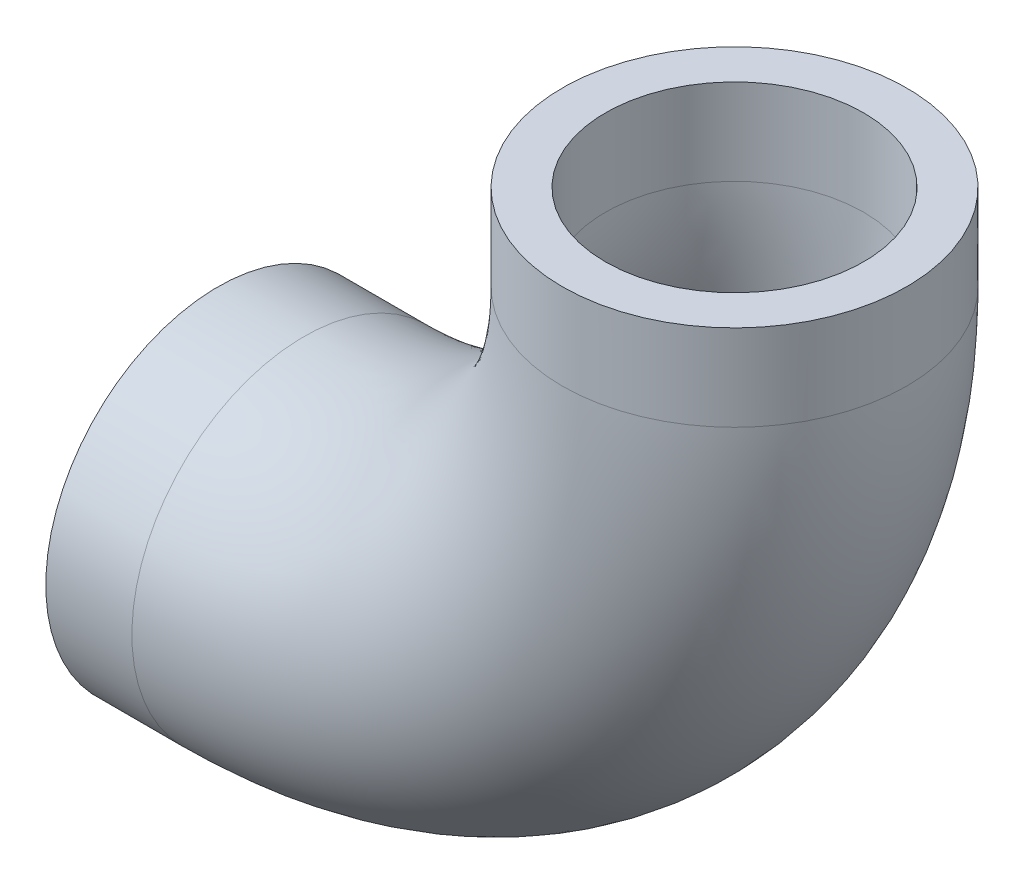
ISO-10303-21;
HEADER;
FILE_DESCRIPTION(('STEP AP214'),'2;1');
FILE_NAME('part.step','',(''),(''),'','','');
FILE_SCHEMA(('AUTOMOTIVE_DESIGN { 1 0 10303 214 1 1 1 1 }'));
ENDSEC;
DATA;
#1=APPLICATION_CONTEXT('core data for automotive mechanical design processes');
#2=APPLICATION_PROTOCOL_DEFINITION('international standard','automotive_design',2000,#1);
#3=PRODUCT_CONTEXT('',#1,'mechanical');
#4=PRODUCT('Part','Part','',(#3));
#5=PRODUCT_RELATED_PRODUCT_CATEGORY('part','',(#4));
#6=PRODUCT_DEFINITION_FORMATION('','',#4);
#7=PRODUCT_DEFINITION_CONTEXT('part definition',#1,'design');
#8=PRODUCT_DEFINITION('design','',#6,#7);
#9=PRODUCT_DEFINITION_SHAPE('','',#8);
#10=(LENGTH_UNIT() NAMED_UNIT(*) SI_UNIT(.MILLI.,.METRE.));
#11=(NAMED_UNIT(*) PLANE_ANGLE_UNIT() SI_UNIT($,.RADIAN.));
#12=(NAMED_UNIT(*) SI_UNIT($,.STERADIAN.) SOLID_ANGLE_UNIT());
#13=UNCERTAINTY_MEASURE_WITH_UNIT(LENGTH_MEASURE(1.E-05),#10,'distance_accuracy_value','');
#14=(GEOMETRIC_REPRESENTATION_CONTEXT(3) GLOBAL_UNCERTAINTY_ASSIGNED_CONTEXT((#13)) GLOBAL_UNIT_ASSIGNED_CONTEXT((#10,
#11,#12)) REPRESENTATION_CONTEXT('',''));
#15=CARTESIAN_POINT('',(0.,0.,0.));
#16=DIRECTION('',(0.,0.,1.));
#17=DIRECTION('',(1.,0.,0.));
#18=AXIS2_PLACEMENT_3D('',#15,#16,#17);
#19=CARTESIAN_POINT('',(6.35,31.75,0.));
#20=DIRECTION('',(0.,0.,1.));
#21=DIRECTION('',(0.,1.,0.));
#22=AXIS2_PLACEMENT_3D('',#19,#20,#21);
#23=TOROIDAL_SURFACE('',#22,31.75,9.525);
#24=CARTESIAN_POINT('',(38.1,31.75,0.));
#25=DIRECTION('',(0.,1.,0.));
#26=DIRECTION('',(0.,0.,1.));
#27=AXIS2_PLACEMENT_3D('',#24,#25,#26);
#28=CIRCLE('',#27,9.525);
#29=CARTESIAN_POINT('',(38.1,31.75,9.525));
#30=VERTEX_POINT('',#29);
#31=EDGE_CURVE('E35',#30,#30,#28,.T.);
#32=ORIENTED_EDGE('',*,*,#31,.T.);
#33=EDGE_LOOP('',(#32));
#34=FACE_BOUND('',#33,.T.);
#35=CARTESIAN_POINT('',(6.35,0.,0.));
#36=DIRECTION('',(1.,0.,0.));
#37=DIRECTION('',(0.,0.,-1.));
#38=AXIS2_PLACEMENT_3D('',#35,#36,#37);
#39=CIRCLE('',#38,9.525);
#40=CARTESIAN_POINT('',(6.35,0.,-9.525));
#41=VERTEX_POINT('',#40);
#42=EDGE_CURVE('E33',#41,#41,#39,.F.);
#43=ORIENTED_EDGE('',*,*,#42,.T.);
#44=EDGE_LOOP('',(#43));
#45=FACE_BOUND('',#44,.T.);
#46=ADVANCED_FACE('F15',(#34,#45),#23,.F.);
#47=CARTESIAN_POINT('',(38.1,31.75,0.));
#48=DIRECTION('',(0.,1.,0.));
#49=DIRECTION('',(0.,0.,1.));
#50=AXIS2_PLACEMENT_3D('',#47,#48,#49);
#51=CYLINDRICAL_SURFACE('',#50,9.525);
#52=CARTESIAN_POINT('',(38.1,38.1,0.));
#53=DIRECTION('',(0.,1.,0.));
#54=DIRECTION('',(0.,0.,1.));
#55=AXIS2_PLACEMENT_3D('',#52,#53,#54);
#56=CIRCLE('',#55,9.525);
#57=CARTESIAN_POINT('',(38.1,38.1,9.525));
#58=VERTEX_POINT('',#57);
#59=EDGE_CURVE('E19',#58,#58,#56,.F.);
#60=ORIENTED_EDGE('',*,*,#59,.F.);
#61=EDGE_LOOP('',(#60));
#62=FACE_BOUND('',#61,.T.);
#63=ORIENTED_EDGE('',*,*,#31,.F.);
#64=EDGE_LOOP('',(#63));
#65=FACE_BOUND('',#64,.T.);
#66=ADVANCED_FACE('F54',(#62,#65),#51,.F.);
#67=CARTESIAN_POINT('',(0.,0.,0.));
#68=DIRECTION('',(1.,0.,0.));
#69=DIRECTION('',(0.,0.,-1.));
#70=AXIS2_PLACEMENT_3D('',#67,#68,#69);
#71=CYLINDRICAL_SURFACE('',#70,9.525);
#72=ORIENTED_EDGE('',*,*,#42,.F.);
#73=EDGE_LOOP('',(#72));
#74=FACE_BOUND('',#73,.T.);
#75=CARTESIAN_POINT('',(0.,0.,0.));
#76=DIRECTION('',(1.,0.,0.));
#77=DIRECTION('',(0.,0.,-1.));
#78=AXIS2_PLACEMENT_3D('',#75,#76,#77);
#79=CIRCLE('',#78,9.525);
#80=CARTESIAN_POINT('',(0.,0.,-9.525));
#81=VERTEX_POINT('',#80);
#82=EDGE_CURVE('E44',#81,#81,#79,.F.);
#83=ORIENTED_EDGE('',*,*,#82,.T.);
#84=EDGE_LOOP('',(#83));
#85=FACE_BOUND('',#84,.T.);
#86=ADVANCED_FACE('F57',(#74,#85),#71,.F.);
#87=CARTESIAN_POINT('',(38.1,38.1,0.));
#88=DIRECTION('',(0.,1.,0.));
#89=DIRECTION('',(0.,0.,1.));
#90=AXIS2_PLACEMENT_3D('',#87,#88,#89);
#91=PLANE('',#90);
#92=ORIENTED_EDGE('',*,*,#59,.T.);
#93=EDGE_LOOP('',(#92));
#94=FACE_BOUND('',#93,.T.);
#95=CARTESIAN_POINT('',(38.1,38.1,0.));
#96=DIRECTION('',(0.,1.,0.));
#97=DIRECTION('',(0.,0.,1.));
#98=AXIS2_PLACEMENT_3D('',#95,#96,#97);
#99=CIRCLE('',#98,12.7);
#100=CARTESIAN_POINT('',(38.1,38.1,12.7));
#101=VERTEX_POINT('',#100);
#102=EDGE_CURVE('E42',#101,#101,#99,.F.);
#103=ORIENTED_EDGE('',*,*,#102,.F.);
#104=EDGE_LOOP('',(#103));
#105=FACE_BOUND('',#104,.T.);
#106=ADVANCED_FACE('F51',(#94,#105),#91,.T.);
#107=CARTESIAN_POINT('',(0.,0.,0.));
#108=DIRECTION('',(1.,0.,0.));
#109=DIRECTION('',(0.,0.,-1.));
#110=AXIS2_PLACEMENT_3D('',#107,#108,#109);
#111=PLANE('',#110);
#112=ORIENTED_EDGE('',*,*,#82,.F.);
#113=EDGE_LOOP('',(#112));
#114=FACE_BOUND('',#113,.T.);
#115=CARTESIAN_POINT('',(0.,0.,0.));
#116=DIRECTION('',(1.,0.,0.));
#117=DIRECTION('',(0.,0.,-1.));
#118=AXIS2_PLACEMENT_3D('',#115,#116,#117);
#119=CIRCLE('',#118,12.7);
#120=CARTESIAN_POINT('',(0.,0.,-12.7));
#121=VERTEX_POINT('',#120);
#122=EDGE_CURVE('E28',#121,#121,#119,.T.);
#123=ORIENTED_EDGE('',*,*,#122,.F.);
#124=EDGE_LOOP('',(#123));
#125=FACE_BOUND('',#124,.T.);
#126=ADVANCED_FACE('F70',(#114,#125),#111,.F.);
#127=CARTESIAN_POINT('',(38.1,31.75,0.));
#128=DIRECTION('',(0.,1.,0.));
#129=DIRECTION('',(0.,0.,1.));
#130=AXIS2_PLACEMENT_3D('',#127,#128,#129);
#131=CYLINDRICAL_SURFACE('',#130,12.7);
#132=ORIENTED_EDGE('',*,*,#102,.T.);
#133=EDGE_LOOP('',(#132));
#134=FACE_BOUND('',#133,.T.);
#135=CARTESIAN_POINT('',(38.1,31.75,0.));
#136=DIRECTION('',(0.,1.,0.));
#137=DIRECTION('',(1.,0.,0.));
#138=AXIS2_PLACEMENT_3D('',#135,#136,#137);
#139=CIRCLE('',#138,12.7);
#140=CARTESIAN_POINT('',(50.8,31.75,0.));
#141=VERTEX_POINT('',#140);
#142=EDGE_CURVE('E23',#141,#141,#139,.F.);
#143=ORIENTED_EDGE('',*,*,#142,.F.);
#144=EDGE_LOOP('',(#143));
#145=FACE_BOUND('',#144,.T.);
#146=ADVANCED_FACE('F80',(#134,#145),#131,.T.);
#147=CARTESIAN_POINT('',(0.,0.,0.));
#148=DIRECTION('',(1.,0.,0.));
#149=DIRECTION('',(0.,0.,-1.));
#150=AXIS2_PLACEMENT_3D('',#147,#148,#149);
#151=CYLINDRICAL_SURFACE('',#150,12.7);
#152=CARTESIAN_POINT('',(6.35,0.,0.));
#153=DIRECTION('',(1.,0.,0.));
#154=DIRECTION('',(0.,-1.,0.));
#155=AXIS2_PLACEMENT_3D('',#152,#153,#154);
#156=CIRCLE('',#155,12.7);
#157=CARTESIAN_POINT('',(6.34999999999999,-12.7,0.));
#158=VERTEX_POINT('',#157);
#159=EDGE_CURVE('E10',#158,#158,#156,.T.);
#160=ORIENTED_EDGE('',*,*,#159,.F.);
#161=EDGE_LOOP('',(#160));
#162=FACE_BOUND('',#161,.T.);
#163=ORIENTED_EDGE('',*,*,#122,.T.);
#164=EDGE_LOOP('',(#163));
#165=FACE_BOUND('',#164,.T.);
#166=ADVANCED_FACE('F74',(#162,#165),#151,.T.);
#167=CARTESIAN_POINT('',(6.35,31.75,0.));
#168=DIRECTION('',(0.,0.,1.));
#169=DIRECTION('',(0.,1.,0.));
#170=AXIS2_PLACEMENT_3D('',#167,#168,#169);
#171=TOROIDAL_SURFACE('',#170,31.75,12.7);
#172=ORIENTED_EDGE('',*,*,#142,.T.);
#173=EDGE_LOOP('',(#172));
#174=FACE_BOUND('',#173,.T.);
#175=ORIENTED_EDGE('',*,*,#159,.T.);
#176=EDGE_LOOP('',(#175));
#177=FACE_BOUND('',#176,.T.);
#178=ADVANCED_FACE('F72',(#174,#177),#171,.T.);
#179=CLOSED_SHELL('',(#46,#66,#86,#106,#126,#146,#166,#178));
#180=MANIFOLD_SOLID_BREP('B1',#179);
#181=ADVANCED_BREP_SHAPE_REPRESENTATION('',(#18,#180),#14);
#182=SHAPE_DEFINITION_REPRESENTATION(#9,#181);
ENDSEC;
END-ISO-10303-21;
